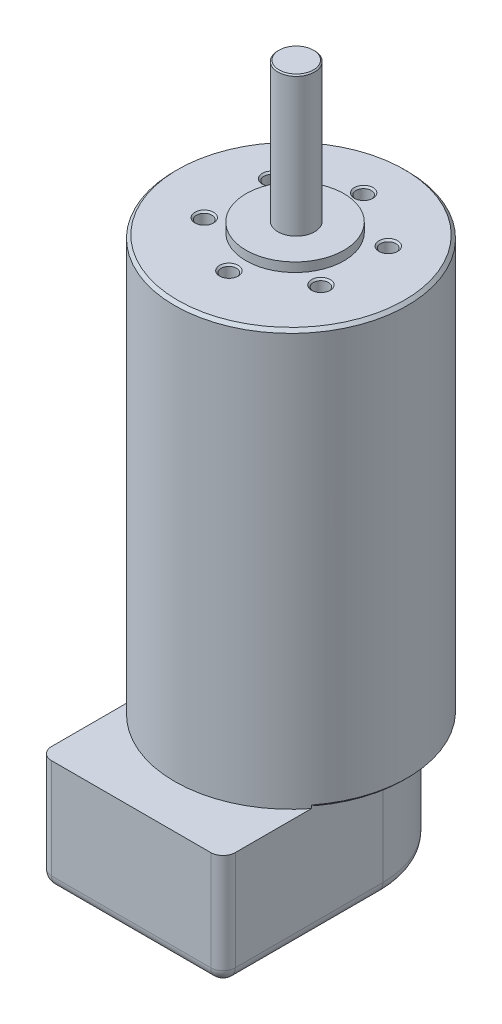
ISO-10303-21;
HEADER;
FILE_DESCRIPTION(('STEP AP214'),'2;1');
FILE_NAME('part.step','',(''),(''),'','','');
FILE_SCHEMA(('AUTOMOTIVE_DESIGN { 1 0 10303 214 1 1 1 1 }'));
ENDSEC;
DATA;
#1=APPLICATION_CONTEXT('core data for automotive mechanical design processes');
#2=APPLICATION_PROTOCOL_DEFINITION('international standard','automotive_design',2000,#1);
#3=PRODUCT_CONTEXT('',#1,'mechanical');
#4=PRODUCT('Part','Part','',(#3));
#5=PRODUCT_RELATED_PRODUCT_CATEGORY('part','',(#4));
#6=PRODUCT_DEFINITION_FORMATION('','',#4);
#7=PRODUCT_DEFINITION_CONTEXT('part definition',#1,'design');
#8=PRODUCT_DEFINITION('design','',#6,#7);
#9=PRODUCT_DEFINITION_SHAPE('','',#8);
#10=(LENGTH_UNIT() NAMED_UNIT(*) SI_UNIT(.MILLI.,.METRE.));
#11=(NAMED_UNIT(*) PLANE_ANGLE_UNIT() SI_UNIT($,.RADIAN.));
#12=(NAMED_UNIT(*) SI_UNIT($,.STERADIAN.) SOLID_ANGLE_UNIT());
#13=UNCERTAINTY_MEASURE_WITH_UNIT(LENGTH_MEASURE(1.E-05),#10,'distance_accuracy_value','');
#14=(GEOMETRIC_REPRESENTATION_CONTEXT(3) GLOBAL_UNCERTAINTY_ASSIGNED_CONTEXT((#13)) GLOBAL_UNIT_ASSIGNED_CONTEXT((#10,
#11,#12)) REPRESENTATION_CONTEXT('',''));
#15=CARTESIAN_POINT('',(0.,0.,0.));
#16=DIRECTION('',(0.,0.,1.));
#17=DIRECTION('',(1.,0.,0.));
#18=AXIS2_PLACEMENT_3D('',#15,#16,#17);
#19=CARTESIAN_POINT('',(13.,18.3,12.05));
#20=DIRECTION('',(0.,-1.,0.));
#21=DIRECTION('',(0.,0.,-1.));
#22=AXIS2_PLACEMENT_3D('',#19,#20,#21);
#23=CYLINDRICAL_SURFACE('',#22,2.);
#24=DIRECTION('',(0.,-1.,0.));
#25=VECTOR('',#24,1.);
#26=CARTESIAN_POINT('',(13.,18.3,14.05));
#27=LINE('',#26,#25);
#28=CARTESIAN_POINT('',(13.,18.3,14.05));
#29=VERTEX_POINT('',#28);
#30=CARTESIAN_POINT('',(13.,2.,14.05));
#31=VERTEX_POINT('',#30);
#32=EDGE_CURVE('E233',#29,#31,#27,.T.);
#33=ORIENTED_EDGE('',*,*,#32,.T.);
#34=CARTESIAN_POINT('',(13.,2.,12.05));
#35=DIRECTION('',(0.,-1.,0.));
#36=DIRECTION('',(0.,0.,-1.));
#37=AXIS2_PLACEMENT_3D('',#34,#35,#36);
#38=CIRCLE('',#37,2.);
#39=CARTESIAN_POINT('',(15.,2.,12.05));
#40=VERTEX_POINT('',#39);
#41=EDGE_CURVE('E269',#31,#40,#38,.F.);
#42=ORIENTED_EDGE('',*,*,#41,.T.);
#43=DIRECTION('',(0.,-1.,0.));
#44=VECTOR('',#43,1.);
#45=CARTESIAN_POINT('',(15.,18.3,12.05));
#46=LINE('',#45,#44);
#47=CARTESIAN_POINT('',(15.,18.3,12.05));
#48=VERTEX_POINT('',#47);
#49=EDGE_CURVE('E248',#48,#40,#46,.T.);
#50=ORIENTED_EDGE('',*,*,#49,.F.);
#51=CARTESIAN_POINT('',(13.,18.3,12.05));
#52=DIRECTION('',(0.,1.,0.));
#53=DIRECTION('',(0.,0.,1.));
#54=AXIS2_PLACEMENT_3D('',#51,#52,#53);
#55=CIRCLE('',#54,2.);
#56=EDGE_CURVE('E215',#29,#48,#55,.T.);
#57=ORIENTED_EDGE('',*,*,#56,.F.);
#58=EDGE_LOOP('',(#33,#42,#50,#57));
#59=FACE_BOUND('',#58,.T.);
#60=ADVANCED_FACE('F34',(#59),#23,.T.);
#61=CARTESIAN_POINT('',(15.,18.3,-12.05));
#62=DIRECTION('',(-1.,0.,0.));
#63=DIRECTION('',(0.,0.,1.));
#64=AXIS2_PLACEMENT_3D('',#61,#62,#63);
#65=PLANE('',#64);
#66=ORIENTED_EDGE('',*,*,#49,.T.);
#67=DIRECTION('',(0.,0.,-1.));
#68=VECTOR('',#67,1.);
#69=CARTESIAN_POINT('',(15.,2.,-12.05));
#70=LINE('',#69,#68);
#71=CARTESIAN_POINT('',(15.,2.,-12.05));
#72=VERTEX_POINT('',#71);
#73=EDGE_CURVE('E267',#40,#72,#70,.T.);
#74=ORIENTED_EDGE('',*,*,#73,.T.);
#75=DIRECTION('',(0.,-1.,0.));
#76=VECTOR('',#75,1.);
#77=CARTESIAN_POINT('',(15.,18.3,-12.05));
#78=LINE('',#77,#76);
#79=CARTESIAN_POINT('',(15.,18.3,-12.05));
#80=VERTEX_POINT('',#79);
#81=EDGE_CURVE('E245',#80,#72,#78,.T.);
#82=ORIENTED_EDGE('',*,*,#81,.F.);
#83=DIRECTION('',(0.,0.,-1.));
#84=VECTOR('',#83,1.);
#85=CARTESIAN_POINT('',(15.,18.3,-12.05));
#86=LINE('',#85,#84);
#87=CARTESIAN_POINT('',(15.,18.3,-1.22179608614613));
#88=VERTEX_POINT('',#87);
#89=EDGE_CURVE('E218',#88,#80,#86,.T.);
#90=ORIENTED_EDGE('',*,*,#89,.F.);
#91=CARTESIAN_POINT('',(15.,18.3,-1.22179608614613));
#92=CARTESIAN_POINT('',(15.,18.3818785551797,-1.08197355466219));
#93=CARTESIAN_POINT('',(15.,18.4644845149293,-0.942587274036707));
#94=CARTESIAN_POINT('',(15.,18.6311511826593,-0.66468731606218));
#95=CARTESIAN_POINT('',(15.,18.7152118895763,-0.526173638075423));
#96=CARTESIAN_POINT('',(15.,18.8,-0.3880962103094));
#97=B_SPLINE_CURVE_WITH_KNOTS('',3,(#91,#92,#93,#94,#95,#96),.UNSPECIFIED.,.F.,.F.,(4,2,4),(0.,
0.486076658887052,0.972152962497277),.UNSPECIFIED.);
#98=CARTESIAN_POINT('',(15.,18.8,-0.388096210309399));
#99=VERTEX_POINT('',#98);
#100=EDGE_CURVE('E11',#88,#99,#97,.T.);
#101=ORIENTED_EDGE('',*,*,#100,.T.);
#102=DIRECTION('',(0.,-1.,0.));
#103=VECTOR('',#102,1.);
#104=CARTESIAN_POINT('',(15.,18.3,-0.388096210309399));
#105=LINE('',#104,#103);
#106=CARTESIAN_POINT('',(15.,18.3,-0.388096210309399));
#107=VERTEX_POINT('',#106);
#108=EDGE_CURVE('E53',#107,#99,#105,.F.);
#109=ORIENTED_EDGE('',*,*,#108,.F.);
#110=EDGE_CURVE('E220',#48,#107,#86,.T.);
#111=ORIENTED_EDGE('',*,*,#110,.F.);
#112=EDGE_LOOP('',(#66,#74,#82,#90,#101,#109,#111));
#113=FACE_BOUND('',#112,.T.);
#114=ADVANCED_FACE('F315',(#113),#65,.F.);
#115=CARTESIAN_POINT('',(0.,18.3,-12.05));
#116=DIRECTION('',(0.,-1.,0.));
#117=DIRECTION('',(0.,0.,-1.));
#118=AXIS2_PLACEMENT_3D('',#115,#116,#117);
#119=CYLINDRICAL_SURFACE('',#118,15.);
#120=ORIENTED_EDGE('',*,*,#81,.T.);
#121=CARTESIAN_POINT('',(0.,2.,-12.05));
#122=DIRECTION('',(0.,1.,0.));
#123=DIRECTION('',(0.,0.,1.));
#124=AXIS2_PLACEMENT_3D('',#121,#122,#123);
#125=CIRCLE('',#124,15.);
#126=CARTESIAN_POINT('',(-15.,2.,-12.05));
#127=VERTEX_POINT('',#126);
#128=EDGE_CURVE('E265',#72,#127,#125,.T.);
#129=ORIENTED_EDGE('',*,*,#128,.T.);
#130=DIRECTION('',(0.,-1.,0.));
#131=VECTOR('',#130,1.);
#132=CARTESIAN_POINT('',(-15.,18.3,-12.05));
#133=LINE('',#132,#131);
#134=CARTESIAN_POINT('',(-15.,18.3,-12.05));
#135=VERTEX_POINT('',#134);
#136=EDGE_CURVE('E242',#135,#127,#133,.T.);
#137=ORIENTED_EDGE('',*,*,#136,.F.);
#138=CARTESIAN_POINT('',(0.,18.3,-12.05));
#139=DIRECTION('',(0.,1.,0.));
#140=DIRECTION('',(0.,0.,-1.));
#141=AXIS2_PLACEMENT_3D('',#138,#139,#140);
#142=CIRCLE('',#141,15.);
#143=EDGE_CURVE('E223',#80,#135,#142,.T.);
#144=ORIENTED_EDGE('',*,*,#143,.F.);
#145=EDGE_LOOP('',(#120,#129,#137,#144));
#146=FACE_BOUND('',#145,.T.);
#147=ADVANCED_FACE('F312',(#146),#119,.T.);
#148=CARTESIAN_POINT('',(-15.,18.3,-12.05));
#149=DIRECTION('',(1.,0.,0.));
#150=DIRECTION('',(0.,0.,-1.));
#151=AXIS2_PLACEMENT_3D('',#148,#149,#150);
#152=PLANE('',#151);
#153=ORIENTED_EDGE('',*,*,#136,.T.);
#154=DIRECTION('',(0.,0.,1.));
#155=VECTOR('',#154,1.);
#156=CARTESIAN_POINT('',(-15.,2.,-12.05));
#157=LINE('',#156,#155);
#158=CARTESIAN_POINT('',(-15.,2.,12.05));
#159=VERTEX_POINT('',#158);
#160=EDGE_CURVE('E254',#127,#159,#157,.T.);
#161=ORIENTED_EDGE('',*,*,#160,.T.);
#162=DIRECTION('',(0.,-1.,0.));
#163=VECTOR('',#162,1.);
#164=CARTESIAN_POINT('',(-15.,18.3,12.05));
#165=LINE('',#164,#163);
#166=CARTESIAN_POINT('',(-15.,18.3,12.05));
#167=VERTEX_POINT('',#166);
#168=EDGE_CURVE('E239',#167,#159,#165,.T.);
#169=ORIENTED_EDGE('',*,*,#168,.F.);
#170=DIRECTION('',(0.,0.,1.));
#171=VECTOR('',#170,1.);
#172=CARTESIAN_POINT('',(-15.,18.3,-12.05));
#173=LINE('',#172,#171);
#174=CARTESIAN_POINT('',(-15.,18.3,-0.388096210309399));
#175=VERTEX_POINT('',#174);
#176=EDGE_CURVE('E226',#175,#167,#173,.T.);
#177=ORIENTED_EDGE('',*,*,#176,.F.);
#178=DIRECTION('',(0.,-1.,0.));
#179=VECTOR('',#178,1.);
#180=CARTESIAN_POINT('',(-15.,18.8,-0.388096210309399));
#181=LINE('',#180,#179);
#182=CARTESIAN_POINT('',(-15.,18.8,-0.388096210309399));
#183=VERTEX_POINT('',#182);
#184=EDGE_CURVE('E299',#183,#175,#181,.T.);
#185=ORIENTED_EDGE('',*,*,#184,.F.);
#186=CARTESIAN_POINT('',(-15.,18.8,-0.388096210309399));
#187=CARTESIAN_POINT('',(-15.,18.7152118895763,-0.526173638075423));
#188=CARTESIAN_POINT('',(-15.,18.6311511826593,-0.664687316062179));
#189=CARTESIAN_POINT('',(-15.,18.4644845149293,-0.942587274036707));
#190=CARTESIAN_POINT('',(-15.,18.3818785551797,-1.08197355466219));
#191=CARTESIAN_POINT('',(-15.,18.3,-1.22179608614613));
#192=B_SPLINE_CURVE_WITH_KNOTS('',3,(#186,#187,#188,#189,#190,#191),.UNSPECIFIED.,.F.,.F.,(4,2,
4),(0.,0.486076303610225,0.972152962497278),.UNSPECIFIED.);
#193=CARTESIAN_POINT('',(-15.,18.3,-1.22179608614613));
#194=VERTEX_POINT('',#193);
#195=EDGE_CURVE('E47',#183,#194,#192,.T.);
#196=ORIENTED_EDGE('',*,*,#195,.T.);
#197=EDGE_CURVE('E227',#135,#194,#173,.T.);
#198=ORIENTED_EDGE('',*,*,#197,.F.);
#199=EDGE_LOOP('',(#153,#161,#169,#177,#185,#196,#198));
#200=FACE_BOUND('',#199,.T.);
#201=ADVANCED_FACE('F306',(#200),#152,.F.);
#202=CARTESIAN_POINT('',(-13.,18.3,12.05));
#203=DIRECTION('',(0.,-1.,0.));
#204=DIRECTION('',(0.,0.,-1.));
#205=AXIS2_PLACEMENT_3D('',#202,#203,#204);
#206=CYLINDRICAL_SURFACE('',#205,2.);
#207=ORIENTED_EDGE('',*,*,#168,.T.);
#208=CARTESIAN_POINT('',(-13.,2.,12.05));
#209=DIRECTION('',(0.,-1.,0.));
#210=DIRECTION('',(0.,0.,-1.));
#211=AXIS2_PLACEMENT_3D('',#208,#209,#210);
#212=CIRCLE('',#211,2.);
#213=CARTESIAN_POINT('',(-13.,2.,14.05));
#214=VERTEX_POINT('',#213);
#215=EDGE_CURVE('E251',#159,#214,#212,.F.);
#216=ORIENTED_EDGE('',*,*,#215,.T.);
#217=DIRECTION('',(0.,-1.,0.));
#218=VECTOR('',#217,1.);
#219=CARTESIAN_POINT('',(-13.,18.3,14.05));
#220=LINE('',#219,#218);
#221=CARTESIAN_POINT('',(-13.,18.3,14.05));
#222=VERTEX_POINT('',#221);
#223=EDGE_CURVE('E236',#222,#214,#220,.T.);
#224=ORIENTED_EDGE('',*,*,#223,.F.);
#225=CARTESIAN_POINT('',(-13.,18.3,12.05));
#226=DIRECTION('',(0.,1.,0.));
#227=DIRECTION('',(0.,0.,1.));
#228=AXIS2_PLACEMENT_3D('',#225,#226,#227);
#229=CIRCLE('',#228,2.);
#230=EDGE_CURVE('E229',#167,#222,#229,.T.);
#231=ORIENTED_EDGE('',*,*,#230,.F.);
#232=EDGE_LOOP('',(#207,#216,#224,#231));
#233=FACE_BOUND('',#232,.T.);
#234=ADVANCED_FACE('F311',(#233),#206,.T.);
#235=CARTESIAN_POINT('',(-13.,18.3,14.05));
#236=DIRECTION('',(0.,0.,-1.));
#237=DIRECTION('',(-1.,0.,0.));
#238=AXIS2_PLACEMENT_3D('',#235,#236,#237);
#239=PLANE('',#238);
#240=ORIENTED_EDGE('',*,*,#223,.T.);
#241=DIRECTION('',(1.,0.,0.));
#242=VECTOR('',#241,1.);
#243=CARTESIAN_POINT('',(-13.,2.,14.05));
#244=LINE('',#243,#242);
#245=EDGE_CURVE('E214',#214,#31,#244,.T.);
#246=ORIENTED_EDGE('',*,*,#245,.T.);
#247=ORIENTED_EDGE('',*,*,#32,.F.);
#248=DIRECTION('',(1.,0.,0.));
#249=VECTOR('',#248,1.);
#250=CARTESIAN_POINT('',(-13.,18.3,14.05));
#251=LINE('',#250,#249);
#252=EDGE_CURVE('E231',#222,#29,#251,.T.);
#253=ORIENTED_EDGE('',*,*,#252,.F.);
#254=EDGE_LOOP('',(#240,#246,#247,#253));
#255=FACE_BOUND('',#254,.T.);
#256=ADVANCED_FACE('F410',(#255),#239,.F.);
#257=CARTESIAN_POINT('',(13.,18.3,12.05));
#258=DIRECTION('',(0.,1.,0.));
#259=DIRECTION('',(0.,0.,1.));
#260=AXIS2_PLACEMENT_3D('',#257,#258,#259);
#261=PLANE('',#260);
#262=CARTESIAN_POINT('',(0.,18.3,-12.05));
#263=DIRECTION('',(0.,1.,0.));
#264=DIRECTION('',(0.,0.,1.));
#265=AXIS2_PLACEMENT_3D('',#262,#263,#264);
#266=CIRCLE('',#265,19.);
#267=EDGE_CURVE('E211',#175,#107,#266,.T.);
#268=ORIENTED_EDGE('',*,*,#267,.F.);
#269=ORIENTED_EDGE('',*,*,#176,.T.);
#270=ORIENTED_EDGE('',*,*,#230,.T.);
#271=ORIENTED_EDGE('',*,*,#252,.T.);
#272=ORIENTED_EDGE('',*,*,#56,.T.);
#273=ORIENTED_EDGE('',*,*,#110,.T.);
#274=EDGE_LOOP('',(#268,#269,#270,#271,#272,#273));
#275=FACE_BOUND('',#274,.T.);
#276=ADVANCED_FACE('F407',(#275),#261,.T.);
#277=CARTESIAN_POINT('',(13.,0.,12.05));
#278=DIRECTION('',(0.,1.,0.));
#279=DIRECTION('',(0.,0.,1.));
#280=AXIS2_PLACEMENT_3D('',#277,#278,#279);
#281=PLANE('',#280);
#282=DIRECTION('',(1.,0.,0.));
#283=VECTOR('',#282,1.);
#284=CARTESIAN_POINT('',(13.,0.,12.05));
#285=LINE('',#284,#283);
#286=CARTESIAN_POINT('',(13.,0.,12.05));
#287=VERTEX_POINT('',#286);
#288=CARTESIAN_POINT('',(-13.,0.,12.05));
#289=VERTEX_POINT('',#288);
#290=EDGE_CURVE('E256',#287,#289,#285,.F.);
#291=ORIENTED_EDGE('',*,*,#290,.T.);
#292=DIRECTION('',(0.,0.,1.));
#293=VECTOR('',#292,1.);
#294=CARTESIAN_POINT('',(-13.,0.,12.05));
#295=LINE('',#294,#293);
#296=CARTESIAN_POINT('',(-13.,0.,-12.05));
#297=VERTEX_POINT('',#296);
#298=EDGE_CURVE('E262',#289,#297,#295,.F.);
#299=ORIENTED_EDGE('',*,*,#298,.T.);
#300=CARTESIAN_POINT('',(0.,0.,-12.05));
#301=DIRECTION('',(0.,1.,0.));
#302=DIRECTION('',(0.,0.,1.));
#303=AXIS2_PLACEMENT_3D('',#300,#301,#302);
#304=CIRCLE('',#303,13.);
#305=CARTESIAN_POINT('',(13.,0.,-12.05));
#306=VERTEX_POINT('',#305);
#307=EDGE_CURVE('E260',#297,#306,#304,.F.);
#308=ORIENTED_EDGE('',*,*,#307,.T.);
#309=DIRECTION('',(0.,0.,-1.));
#310=VECTOR('',#309,1.);
#311=CARTESIAN_POINT('',(13.,0.,12.05));
#312=LINE('',#311,#310);
#313=EDGE_CURVE('E258',#306,#287,#312,.F.);
#314=ORIENTED_EDGE('',*,*,#313,.T.);
#315=EDGE_LOOP('',(#291,#299,#308,#314));
#316=FACE_BOUND('',#315,.T.);
#317=ADVANCED_FACE('F347',(#316),#281,.F.);
#318=CARTESIAN_POINT('',(13.,2.,-12.05));
#319=DIRECTION('',(0.,0.,-1.));
#320=DIRECTION('',(-1.,0.,0.));
#321=AXIS2_PLACEMENT_3D('',#318,#319,#320);
#322=CYLINDRICAL_SURFACE('',#321,2.);
#323=CARTESIAN_POINT('',(13.,2.,12.05));
#324=DIRECTION('',(0.,0.,1.));
#325=DIRECTION('',(1.,0.,0.));
#326=AXIS2_PLACEMENT_3D('',#323,#324,#325);
#327=CIRCLE('',#326,2.);
#328=EDGE_CURVE('E281',#287,#40,#327,.T.);
#329=ORIENTED_EDGE('',*,*,#328,.F.);
#330=ORIENTED_EDGE('',*,*,#313,.F.);
#331=CARTESIAN_POINT('',(13.,2.,-12.05));
#332=DIRECTION('',(0.,0.,-1.));
#333=DIRECTION('',(-1.,0.,0.));
#334=AXIS2_PLACEMENT_3D('',#331,#332,#333);
#335=CIRCLE('',#334,2.);
#336=EDGE_CURVE('E219',#72,#306,#335,.T.);
#337=ORIENTED_EDGE('',*,*,#336,.F.);
#338=ORIENTED_EDGE('',*,*,#73,.F.);
#339=EDGE_LOOP('',(#329,#330,#337,#338));
#340=FACE_BOUND('',#339,.T.);
#341=ADVANCED_FACE('F343',(#340),#322,.T.);
#342=CARTESIAN_POINT('',(0.,2.,-12.05));
#343=DIRECTION('',(0.,1.,0.));
#344=DIRECTION('',(0.,0.,1.));
#345=AXIS2_PLACEMENT_3D('',#342,#343,#344);
#346=TOROIDAL_SURFACE('',#345,13.,2.);
#347=ORIENTED_EDGE('',*,*,#336,.T.);
#348=ORIENTED_EDGE('',*,*,#307,.F.);
#349=CARTESIAN_POINT('',(-13.,2.,-12.05));
#350=DIRECTION('',(0.,0.,1.));
#351=DIRECTION('',(1.,0.,0.));
#352=AXIS2_PLACEMENT_3D('',#349,#350,#351);
#353=CIRCLE('',#352,2.);
#354=EDGE_CURVE('E279',#127,#297,#353,.T.);
#355=ORIENTED_EDGE('',*,*,#354,.F.);
#356=ORIENTED_EDGE('',*,*,#128,.F.);
#357=EDGE_LOOP('',(#347,#348,#355,#356));
#358=FACE_BOUND('',#357,.T.);
#359=ADVANCED_FACE('F339',(#358),#346,.T.);
#360=CARTESIAN_POINT('',(13.,2.,12.05));
#361=DIRECTION('',(0.,1.,0.));
#362=DIRECTION('',(0.,0.,1.));
#363=AXIS2_PLACEMENT_3D('',#360,#361,#362);
#364=SPHERICAL_SURFACE('',#363,2.);
#365=ORIENTED_EDGE('',*,*,#328,.T.);
#366=ORIENTED_EDGE('',*,*,#41,.F.);
#367=CARTESIAN_POINT('',(13.,2.,12.05));
#368=DIRECTION('',(-1.,0.,0.));
#369=DIRECTION('',(0.,0.,1.));
#370=AXIS2_PLACEMENT_3D('',#367,#368,#369);
#371=CIRCLE('',#370,2.);
#372=EDGE_CURVE('E276',#287,#31,#371,.T.);
#373=ORIENTED_EDGE('',*,*,#372,.F.);
#374=EDGE_LOOP('',(#365,#366,#373));
#375=FACE_BOUND('',#374,.T.);
#376=ADVANCED_FACE('F335',(#375),#364,.T.);
#377=CARTESIAN_POINT('',(-13.,2.,-12.05));
#378=DIRECTION('',(0.,0.,1.));
#379=DIRECTION('',(1.,0.,0.));
#380=AXIS2_PLACEMENT_3D('',#377,#378,#379);
#381=CYLINDRICAL_SURFACE('',#380,2.);
#382=ORIENTED_EDGE('',*,*,#354,.T.);
#383=ORIENTED_EDGE('',*,*,#298,.F.);
#384=CARTESIAN_POINT('',(-13.,2.,12.05));
#385=DIRECTION('',(0.,0.,1.));
#386=DIRECTION('',(1.,0.,0.));
#387=AXIS2_PLACEMENT_3D('',#384,#385,#386);
#388=CIRCLE('',#387,2.);
#389=EDGE_CURVE('E273',#159,#289,#388,.T.);
#390=ORIENTED_EDGE('',*,*,#389,.F.);
#391=ORIENTED_EDGE('',*,*,#160,.F.);
#392=EDGE_LOOP('',(#382,#383,#390,#391));
#393=FACE_BOUND('',#392,.T.);
#394=ADVANCED_FACE('F331',(#393),#381,.T.);
#395=CARTESIAN_POINT('',(-13.,2.,12.05));
#396=DIRECTION('',(1.,0.,0.));
#397=DIRECTION('',(0.,0.,-1.));
#398=AXIS2_PLACEMENT_3D('',#395,#396,#397);
#399=CYLINDRICAL_SURFACE('',#398,2.);
#400=ORIENTED_EDGE('',*,*,#372,.T.);
#401=ORIENTED_EDGE('',*,*,#245,.F.);
#402=CARTESIAN_POINT('',(-13.,2.,12.05));
#403=DIRECTION('',(-1.,0.,0.));
#404=DIRECTION('',(0.,0.,1.));
#405=AXIS2_PLACEMENT_3D('',#402,#403,#404);
#406=CIRCLE('',#405,2.);
#407=EDGE_CURVE('E207',#289,#214,#406,.T.);
#408=ORIENTED_EDGE('',*,*,#407,.F.);
#409=ORIENTED_EDGE('',*,*,#290,.F.);
#410=EDGE_LOOP('',(#400,#401,#408,#409));
#411=FACE_BOUND('',#410,.T.);
#412=ADVANCED_FACE('F327',(#411),#399,.T.);
#413=CARTESIAN_POINT('',(-13.,2.,12.05));
#414=DIRECTION('',(0.,1.,0.));
#415=DIRECTION('',(0.,0.,1.));
#416=AXIS2_PLACEMENT_3D('',#413,#414,#415);
#417=SPHERICAL_SURFACE('',#416,2.);
#418=ORIENTED_EDGE('',*,*,#215,.F.);
#419=ORIENTED_EDGE('',*,*,#389,.T.);
#420=ORIENTED_EDGE('',*,*,#407,.T.);
#421=EDGE_LOOP('',(#418,#419,#420));
#422=FACE_BOUND('',#421,.T.);
#423=ADVANCED_FACE('F323',(#422),#417,.T.);
#424=CARTESIAN_POINT('',(0.,18.3,-12.05));
#425=DIRECTION('',(0.,1.,0.));
#426=DIRECTION('',(0.,0.,1.));
#427=AXIS2_PLACEMENT_3D('',#424,#425,#426);
#428=PLANE('',#427);
#429=ORIENTED_EDGE('',*,*,#197,.T.);
#430=CARTESIAN_POINT('',(0.,18.3,-12.05));
#431=DIRECTION('',(0.,1.,0.));
#432=DIRECTION('',(0.,0.,1.));
#433=AXIS2_PLACEMENT_3D('',#430,#431,#432);
#434=CIRCLE('',#433,18.5);
#435=EDGE_CURVE('E301',#194,#88,#434,.F.);
#436=ORIENTED_EDGE('',*,*,#435,.T.);
#437=ORIENTED_EDGE('',*,*,#89,.T.);
#438=ORIENTED_EDGE('',*,*,#143,.T.);
#439=EDGE_LOOP('',(#429,#436,#437,#438));
#440=FACE_BOUND('',#439,.T.);
#441=ADVANCED_FACE('F326',(#440),#428,.F.);
#442=CARTESIAN_POINT('',(0.,86.1,-12.05));
#443=DIRECTION('',(0.,-1.,0.));
#444=DIRECTION('',(0.,0.,-1.));
#445=AXIS2_PLACEMENT_3D('',#442,#443,#444);
#446=CYLINDRICAL_SURFACE('',#445,19.);
#447=CARTESIAN_POINT('',(0.,85.6,-12.05));
#448=DIRECTION('',(0.,1.,0.));
#449=DIRECTION('',(0.,0.,1.));
#450=AXIS2_PLACEMENT_3D('',#447,#448,#449);
#451=CIRCLE('',#450,19.);
#452=CARTESIAN_POINT('',(0.,85.6,6.95));
#453=VERTEX_POINT('',#452);
#454=EDGE_CURVE('E210',#453,#453,#451,.F.);
#455=ORIENTED_EDGE('',*,*,#454,.T.);
#456=EDGE_LOOP('',(#455));
#457=FACE_BOUND('',#456,.T.);
#458=CARTESIAN_POINT('',(0.,18.8,-12.05));
#459=DIRECTION('',(0.,1.,0.));
#460=DIRECTION('',(0.,0.,1.));
#461=AXIS2_PLACEMENT_3D('',#458,#459,#460);
#462=CIRCLE('',#461,19.);
#463=EDGE_CURVE('E296',#99,#183,#462,.T.);
#464=ORIENTED_EDGE('',*,*,#463,.T.);
#465=ORIENTED_EDGE('',*,*,#184,.T.);
#466=ORIENTED_EDGE('',*,*,#267,.T.);
#467=ORIENTED_EDGE('',*,*,#108,.T.);
#468=EDGE_LOOP('',(#464,#465,#466,#467));
#469=FACE_BOUND('',#468,.T.);
#470=ADVANCED_FACE('F391',(#457,#469),#446,.T.);
#471=CARTESIAN_POINT('',(0.,86.1,-12.05));
#472=DIRECTION('',(0.,1.,0.));
#473=DIRECTION('',(0.,0.,1.));
#474=AXIS2_PLACEMENT_3D('',#471,#472,#473);
#475=PLANE('',#474);
#476=CARTESIAN_POINT('',(-9.52627944162876,86.1,-18.4106432374949));
#477=DIRECTION('',(0.,1.,0.));
#478=DIRECTION('',(0.,0.,1.));
#479=AXIS2_PLACEMENT_3D('',#476,#477,#478);
#480=CIRCLE('',#479,1.525);
#481=CARTESIAN_POINT('',(-9.52627944162876,86.1,-16.8856432374949));
#482=VERTEX_POINT('',#481);
#483=EDGE_CURVE('E154',#482,#482,#480,.T.);
#484=ORIENTED_EDGE('',*,*,#483,.F.);
#485=EDGE_LOOP('',(#484));
#486=FACE_BOUND('',#485,.T.);
#487=CARTESIAN_POINT('',(-9.52627944162887,86.1,-7.41064323749491));
#488=DIRECTION('',(0.,1.,0.));
#489=DIRECTION('',(0.,0.,1.));
#490=AXIS2_PLACEMENT_3D('',#487,#488,#489);
#491=CIRCLE('',#490,1.525);
#492=CARTESIAN_POINT('',(-9.52627944162887,86.1,-5.88564323749491));
#493=VERTEX_POINT('',#492);
#494=EDGE_CURVE('E147',#493,#493,#491,.T.);
#495=ORIENTED_EDGE('',*,*,#494,.F.);
#496=EDGE_LOOP('',(#495));
#497=FACE_BOUND('',#496,.T.);
#498=CARTESIAN_POINT('',(0.,86.1,-1.91064323749482));
#499=DIRECTION('',(0.,1.,0.));
#500=DIRECTION('',(0.,0.,1.));
#501=AXIS2_PLACEMENT_3D('',#498,#499,#500);
#502=CIRCLE('',#501,1.525);
#503=CARTESIAN_POINT('',(0.,86.1,-0.385643237494823));
#504=VERTEX_POINT('',#503);
#505=EDGE_CURVE('E163',#504,#504,#502,.T.);
#506=ORIENTED_EDGE('',*,*,#505,.F.);
#507=EDGE_LOOP('',(#506));
#508=FACE_BOUND('',#507,.T.);
#509=CARTESIAN_POINT('',(9.5262794416288,86.1,-7.41064323749478));
#510=DIRECTION('',(0.,1.,0.));
#511=DIRECTION('',(0.,0.,1.));
#512=AXIS2_PLACEMENT_3D('',#509,#510,#511);
#513=CIRCLE('',#512,1.525);
#514=CARTESIAN_POINT('',(9.5262794416288,86.1,-5.88564323749478));
#515=VERTEX_POINT('',#514);
#516=EDGE_CURVE('E172',#515,#515,#513,.T.);
#517=ORIENTED_EDGE('',*,*,#516,.F.);
#518=EDGE_LOOP('',(#517));
#519=FACE_BOUND('',#518,.T.);
#520=CARTESIAN_POINT('',(9.52627944162884,86.1,-18.4106432374948));
#521=DIRECTION('',(0.,1.,0.));
#522=DIRECTION('',(0.,0.,1.));
#523=AXIS2_PLACEMENT_3D('',#520,#521,#522);
#524=CIRCLE('',#523,1.525);
#525=CARTESIAN_POINT('',(9.52627944162884,86.1,-16.8856432374948));
#526=VERTEX_POINT('',#525);
#527=EDGE_CURVE('E181',#526,#526,#524,.T.);
#528=ORIENTED_EDGE('',*,*,#527,.F.);
#529=EDGE_LOOP('',(#528));
#530=FACE_BOUND('',#529,.T.);
#531=CARTESIAN_POINT('',(0.,86.1,-23.9106432374948));
#532=DIRECTION('',(0.,1.,0.));
#533=DIRECTION('',(0.,0.,1.));
#534=AXIS2_PLACEMENT_3D('',#531,#532,#533);
#535=CIRCLE('',#534,1.525);
#536=CARTESIAN_POINT('',(0.,86.1,-22.3856432374948));
#537=VERTEX_POINT('',#536);
#538=EDGE_CURVE('E190',#537,#537,#535,.T.);
#539=ORIENTED_EDGE('',*,*,#538,.F.);
#540=EDGE_LOOP('',(#539));
#541=FACE_BOUND('',#540,.T.);
#542=CARTESIAN_POINT('',(0.,86.1,-12.7086290434111));
#543=DIRECTION('',(0.,1.,0.));
#544=DIRECTION('',(0.,0.,1.));
#545=AXIS2_PLACEMENT_3D('',#542,#543,#544);
#546=CIRCLE('',#545,8.);
#547=CARTESIAN_POINT('',(0.,86.1,-4.70862904341109));
#548=VERTEX_POINT('',#547);
#549=EDGE_CURVE('E204',#548,#548,#546,.T.);
#550=ORIENTED_EDGE('',*,*,#549,.F.);
#551=EDGE_LOOP('',(#550));
#552=FACE_BOUND('',#551,.T.);
#553=CARTESIAN_POINT('',(0.,86.1,-12.05));
#554=DIRECTION('',(0.,1.,0.));
#555=DIRECTION('',(0.,0.,1.));
#556=AXIS2_PLACEMENT_3D('',#553,#554,#555);
#557=CIRCLE('',#556,18.5);
#558=CARTESIAN_POINT('',(0.,86.1,6.45));
#559=VERTEX_POINT('',#558);
#560=EDGE_CURVE('E213',#559,#559,#557,.T.);
#561=ORIENTED_EDGE('',*,*,#560,.T.);
#562=EDGE_LOOP('',(#561));
#563=FACE_BOUND('',#562,.T.);
#564=ADVANCED_FACE('F352',(#486,#497,#508,#519,#530,#541,#552,#563),#475,.T.);
#565=CARTESIAN_POINT('',(0.,86.1,-12.05));
#566=DIRECTION('',(0.,-1.,0.));
#567=DIRECTION('',(0.,0.,-1.));
#568=AXIS2_PLACEMENT_3D('',#565,#566,#567);
#569=CONICAL_SURFACE('',#568,18.5,0.785398163397445);
#570=ORIENTED_EDGE('',*,*,#454,.F.);
#571=EDGE_LOOP('',(#570));
#572=FACE_BOUND('',#571,.T.);
#573=ORIENTED_EDGE('',*,*,#560,.F.);
#574=EDGE_LOOP('',(#573));
#575=FACE_BOUND('',#574,.T.);
#576=ADVANCED_FACE('F349',(#572,#575),#569,.T.);
#577=CARTESIAN_POINT('',(0.,87.6,-12.7086290434111));
#578=DIRECTION('',(0.,-1.,0.));
#579=DIRECTION('',(0.,0.,-1.));
#580=AXIS2_PLACEMENT_3D('',#577,#578,#579);
#581=CYLINDRICAL_SURFACE('',#580,8.);
#582=CARTESIAN_POINT('',(0.,87.6,-12.7086290434111));
#583=DIRECTION('',(0.,1.,0.));
#584=DIRECTION('',(0.,0.,1.));
#585=AXIS2_PLACEMENT_3D('',#582,#583,#584);
#586=CIRCLE('',#585,8.);
#587=CARTESIAN_POINT('',(0.,87.6,-4.70862904341109));
#588=VERTEX_POINT('',#587);
#589=EDGE_CURVE('E199',#588,#588,#586,.T.);
#590=ORIENTED_EDGE('',*,*,#589,.F.);
#591=EDGE_LOOP('',(#590));
#592=FACE_BOUND('',#591,.T.);
#593=ORIENTED_EDGE('',*,*,#549,.T.);
#594=EDGE_LOOP('',(#593));
#595=FACE_BOUND('',#594,.T.);
#596=ADVANCED_FACE('F351',(#592,#595),#581,.T.);
#597=CARTESIAN_POINT('',(0.,87.6,-12.7086290434111));
#598=DIRECTION('',(0.,1.,0.));
#599=DIRECTION('',(0.,0.,1.));
#600=AXIS2_PLACEMENT_3D('',#597,#598,#599);
#601=PLANE('',#600);
#602=CARTESIAN_POINT('',(0.,87.6,-12.9106432374948));
#603=DIRECTION('',(0.,1.,0.));
#604=DIRECTION('',(0.,0.,1.));
#605=AXIS2_PLACEMENT_3D('',#602,#603,#604);
#606=CIRCLE('',#605,3.);
#607=CARTESIAN_POINT('',(0.,87.6,-9.91064323749482));
#608=VERTEX_POINT('',#607);
#609=EDGE_CURVE('E200',#608,#608,#606,.T.);
#610=ORIENTED_EDGE('',*,*,#609,.F.);
#611=EDGE_LOOP('',(#610));
#612=FACE_BOUND('',#611,.T.);
#613=ORIENTED_EDGE('',*,*,#589,.T.);
#614=EDGE_LOOP('',(#613));
#615=FACE_BOUND('',#614,.T.);
#616=ADVANCED_FACE('F375',(#612,#615),#601,.T.);
#617=CARTESIAN_POINT('',(0.,110.4,-12.9106432374948));
#618=DIRECTION('',(0.,-1.,0.));
#619=DIRECTION('',(0.,0.,-1.));
#620=AXIS2_PLACEMENT_3D('',#617,#618,#619);
#621=CYLINDRICAL_SURFACE('',#620,3.);
#622=CARTESIAN_POINT('',(0.,110.2,-12.9106432374948));
#623=DIRECTION('',(0.,1.,0.));
#624=DIRECTION('',(0.,0.,1.));
#625=AXIS2_PLACEMENT_3D('',#622,#623,#624);
#626=CIRCLE('',#625,3.);
#627=CARTESIAN_POINT('',(0.,110.2,-9.91064323749482));
#628=VERTEX_POINT('',#627);
#629=EDGE_CURVE('E292',#628,#628,#626,.F.);
#630=ORIENTED_EDGE('',*,*,#629,.T.);
#631=EDGE_LOOP('',(#630));
#632=FACE_BOUND('',#631,.T.);
#633=ORIENTED_EDGE('',*,*,#609,.T.);
#634=EDGE_LOOP('',(#633));
#635=FACE_BOUND('',#634,.T.);
#636=ADVANCED_FACE('F366',(#632,#635),#621,.T.);
#637=CARTESIAN_POINT('',(0.,110.4,-12.9106432374948));
#638=DIRECTION('',(0.,1.,0.));
#639=DIRECTION('',(0.,0.,1.));
#640=AXIS2_PLACEMENT_3D('',#637,#638,#639);
#641=PLANE('',#640);
#642=CARTESIAN_POINT('',(0.,110.4,-12.9106432374948));
#643=DIRECTION('',(0.,1.,0.));
#644=DIRECTION('',(0.,0.,1.));
#645=AXIS2_PLACEMENT_3D('',#642,#643,#644);
#646=CIRCLE('',#645,2.79999999999997);
#647=CARTESIAN_POINT('',(0.,110.4,-10.1106432374949));
#648=VERTEX_POINT('',#647);
#649=EDGE_CURVE('E203',#648,#648,#646,.T.);
#650=ORIENTED_EDGE('',*,*,#649,.T.);
#651=EDGE_LOOP('',(#650));
#652=FACE_BOUND('',#651,.T.);
#653=ADVANCED_FACE('F357',(#652),#641,.T.);
#654=CARTESIAN_POINT('',(0.,110.4,-12.9106432374948));
#655=DIRECTION('',(0.,-1.,0.));
#656=DIRECTION('',(0.,0.,-1.));
#657=AXIS2_PLACEMENT_3D('',#654,#655,#656);
#658=CONICAL_SURFACE('',#657,2.79999999999997,0.785398163397439);
#659=ORIENTED_EDGE('',*,*,#629,.F.);
#660=EDGE_LOOP('',(#659));
#661=FACE_BOUND('',#660,.T.);
#662=ORIENTED_EDGE('',*,*,#649,.F.);
#663=EDGE_LOOP('',(#662));
#664=FACE_BOUND('',#663,.T.);
#665=ADVANCED_FACE('F354',(#661,#664),#658,.T.);
#666=CARTESIAN_POINT('',(0.,83.1,-23.9106432374948));
#667=DIRECTION('',(0.,1.,0.));
#668=DIRECTION('',(0.,0.,1.));
#669=AXIS2_PLACEMENT_3D('',#666,#667,#668);
#670=CONICAL_SURFACE('',#669,1.25,1.02974425867666);
#671=CARTESIAN_POINT('',(0.,82.3489242262155,-23.9106432374948));
#672=VERTEX_POINT('',#671);
#673=VERTEX_LOOP('',#672);
#674=FACE_BOUND('',#673,.T.);
#675=CARTESIAN_POINT('',(0.,83.1,-23.9106432374948));
#676=DIRECTION('',(0.,1.,0.));
#677=DIRECTION('',(0.,0.,1.));
#678=AXIS2_PLACEMENT_3D('',#675,#676,#677);
#679=CIRCLE('',#678,1.25);
#680=CARTESIAN_POINT('',(0.,83.1,-22.6606432374948));
#681=VERTEX_POINT('',#680);
#682=EDGE_CURVE('E196',#681,#681,#679,.T.);
#683=ORIENTED_EDGE('',*,*,#682,.T.);
#684=EDGE_LOOP('',(#683));
#685=FACE_BOUND('',#684,.T.);
#686=ADVANCED_FACE('F356',(#674,#685),#670,.F.);
#687=CARTESIAN_POINT('',(0.,86.1,-23.9106432374948));
#688=DIRECTION('',(0.,1.,0.));
#689=DIRECTION('',(0.,0.,1.));
#690=AXIS2_PLACEMENT_3D('',#687,#688,#689);
#691=CYLINDRICAL_SURFACE('',#690,1.25);
#692=ORIENTED_EDGE('',*,*,#682,.F.);
#693=EDGE_LOOP('',(#692));
#694=FACE_BOUND('',#693,.T.);
#695=CARTESIAN_POINT('',(0.,85.825,-23.9106432374948));
#696=DIRECTION('',(0.,1.,0.));
#697=DIRECTION('',(0.,0.,1.));
#698=AXIS2_PLACEMENT_3D('',#695,#696,#697);
#699=CIRCLE('',#698,1.25);
#700=CARTESIAN_POINT('',(0.,85.825,-22.6606432374948));
#701=VERTEX_POINT('',#700);
#702=EDGE_CURVE('E193',#701,#701,#699,.T.);
#703=ORIENTED_EDGE('',*,*,#702,.T.);
#704=EDGE_LOOP('',(#703));
#705=FACE_BOUND('',#704,.T.);
#706=ADVANCED_FACE('F363',(#694,#705),#691,.F.);
#707=CARTESIAN_POINT('',(0.,86.1,-23.9106432374948));
#708=DIRECTION('',(0.,1.,0.));
#709=DIRECTION('',(0.,0.,1.));
#710=AXIS2_PLACEMENT_3D('',#707,#708,#709);
#711=CONICAL_SURFACE('',#710,1.525,0.785398163397454);
#712=ORIENTED_EDGE('',*,*,#702,.F.);
#713=EDGE_LOOP('',(#712));
#714=FACE_BOUND('',#713,.T.);
#715=ORIENTED_EDGE('',*,*,#538,.T.);
#716=EDGE_LOOP('',(#715));
#717=FACE_BOUND('',#716,.T.);
#718=ADVANCED_FACE('F512',(#714,#717),#711,.F.);
#719=CARTESIAN_POINT('',(9.52627944162884,83.1,-18.4106432374948));
#720=DIRECTION('',(0.,1.,0.));
#721=DIRECTION('',(0.,0.,1.));
#722=AXIS2_PLACEMENT_3D('',#719,#720,#721);
#723=CONICAL_SURFACE('',#722,1.25,1.02974425867666);
#724=CARTESIAN_POINT('',(9.52627944162883,82.3489242262155,-18.4106432374948));
#725=VERTEX_POINT('',#724);
#726=VERTEX_LOOP('',#725);
#727=FACE_BOUND('',#726,.T.);
#728=CARTESIAN_POINT('',(9.52627944162884,83.1,-18.4106432374948));
#729=DIRECTION('',(0.,1.,0.));
#730=DIRECTION('',(0.,0.,1.));
#731=AXIS2_PLACEMENT_3D('',#728,#729,#730);
#732=CIRCLE('',#731,1.25);
#733=CARTESIAN_POINT('',(9.52627944162884,83.1,-17.1606432374948));
#734=VERTEX_POINT('',#733);
#735=EDGE_CURVE('E187',#734,#734,#732,.T.);
#736=ORIENTED_EDGE('',*,*,#735,.T.);
#737=EDGE_LOOP('',(#736));
#738=FACE_BOUND('',#737,.T.);
#739=ADVANCED_FACE('F508',(#727,#738),#723,.F.);
#740=CARTESIAN_POINT('',(9.52627944162884,86.1,-18.4106432374948));
#741=DIRECTION('',(0.,1.,0.));
#742=DIRECTION('',(0.,0.,1.));
#743=AXIS2_PLACEMENT_3D('',#740,#741,#742);
#744=CYLINDRICAL_SURFACE('',#743,1.25);
#745=ORIENTED_EDGE('',*,*,#735,.F.);
#746=EDGE_LOOP('',(#745));
#747=FACE_BOUND('',#746,.T.);
#748=CARTESIAN_POINT('',(9.52627944162884,85.825,-18.4106432374948));
#749=DIRECTION('',(0.,1.,0.));
#750=DIRECTION('',(0.,0.,1.));
#751=AXIS2_PLACEMENT_3D('',#748,#749,#750);
#752=CIRCLE('',#751,1.25);
#753=CARTESIAN_POINT('',(9.52627944162884,85.825,-17.1606432374948));
#754=VERTEX_POINT('',#753);
#755=EDGE_CURVE('E184',#754,#754,#752,.T.);
#756=ORIENTED_EDGE('',*,*,#755,.T.);
#757=EDGE_LOOP('',(#756));
#758=FACE_BOUND('',#757,.T.);
#759=ADVANCED_FACE('F504',(#747,#758),#744,.F.);
#760=CARTESIAN_POINT('',(9.52627944162884,86.1,-18.4106432374948));
#761=DIRECTION('',(0.,1.,0.));
#762=DIRECTION('',(0.,0.,1.));
#763=AXIS2_PLACEMENT_3D('',#760,#761,#762);
#764=CONICAL_SURFACE('',#763,1.525,0.785398163397455);
#765=ORIENTED_EDGE('',*,*,#755,.F.);
#766=EDGE_LOOP('',(#765));
#767=FACE_BOUND('',#766,.T.);
#768=ORIENTED_EDGE('',*,*,#527,.T.);
#769=EDGE_LOOP('',(#768));
#770=FACE_BOUND('',#769,.T.);
#771=ADVANCED_FACE('F500',(#767,#770),#764,.F.);
#772=CARTESIAN_POINT('',(9.5262794416288,83.1,-7.41064323749478));
#773=DIRECTION('',(0.,1.,0.));
#774=DIRECTION('',(0.,0.,1.));
#775=AXIS2_PLACEMENT_3D('',#772,#773,#774);
#776=CONICAL_SURFACE('',#775,1.25,1.02974425867666);
#777=CARTESIAN_POINT('',(9.5262794416288,82.3489242262155,-7.41064323749478));
#778=VERTEX_POINT('',#777);
#779=VERTEX_LOOP('',#778);
#780=FACE_BOUND('',#779,.T.);
#781=CARTESIAN_POINT('',(9.5262794416288,83.1,-7.41064323749478));
#782=DIRECTION('',(0.,1.,0.));
#783=DIRECTION('',(0.,0.,1.));
#784=AXIS2_PLACEMENT_3D('',#781,#782,#783);
#785=CIRCLE('',#784,1.25);
#786=CARTESIAN_POINT('',(9.5262794416288,83.1,-6.16064323749478));
#787=VERTEX_POINT('',#786);
#788=EDGE_CURVE('E178',#787,#787,#785,.T.);
#789=ORIENTED_EDGE('',*,*,#788,.T.);
#790=EDGE_LOOP('',(#789));
#791=FACE_BOUND('',#790,.T.);
#792=ADVANCED_FACE('F496',(#780,#791),#776,.F.);
#793=CARTESIAN_POINT('',(9.5262794416288,86.1,-7.41064323749478));
#794=DIRECTION('',(0.,1.,0.));
#795=DIRECTION('',(0.,0.,1.));
#796=AXIS2_PLACEMENT_3D('',#793,#794,#795);
#797=CYLINDRICAL_SURFACE('',#796,1.25);
#798=ORIENTED_EDGE('',*,*,#788,.F.);
#799=EDGE_LOOP('',(#798));
#800=FACE_BOUND('',#799,.T.);
#801=CARTESIAN_POINT('',(9.5262794416288,85.825,-7.41064323749478));
#802=DIRECTION('',(0.,1.,0.));
#803=DIRECTION('',(0.,0.,1.));
#804=AXIS2_PLACEMENT_3D('',#801,#802,#803);
#805=CIRCLE('',#804,1.25);
#806=CARTESIAN_POINT('',(9.5262794416288,85.825,-6.16064323749478));
#807=VERTEX_POINT('',#806);
#808=EDGE_CURVE('E175',#807,#807,#805,.T.);
#809=ORIENTED_EDGE('',*,*,#808,.T.);
#810=EDGE_LOOP('',(#809));
#811=FACE_BOUND('',#810,.T.);
#812=ADVANCED_FACE('F492',(#800,#811),#797,.F.);
#813=CARTESIAN_POINT('',(9.5262794416288,86.1,-7.41064323749478));
#814=DIRECTION('',(0.,1.,0.));
#815=DIRECTION('',(0.,0.,1.));
#816=AXIS2_PLACEMENT_3D('',#813,#814,#815);
#817=CONICAL_SURFACE('',#816,1.525,0.785398163397455);
#818=ORIENTED_EDGE('',*,*,#808,.F.);
#819=EDGE_LOOP('',(#818));
#820=FACE_BOUND('',#819,.T.);
#821=ORIENTED_EDGE('',*,*,#516,.T.);
#822=EDGE_LOOP('',(#821));
#823=FACE_BOUND('',#822,.T.);
#824=ADVANCED_FACE('F488',(#820,#823),#817,.F.);
#825=CARTESIAN_POINT('',(0.,83.1,-1.91064323749482));
#826=DIRECTION('',(0.,1.,0.));
#827=DIRECTION('',(0.,0.,1.));
#828=AXIS2_PLACEMENT_3D('',#825,#826,#827);
#829=CONICAL_SURFACE('',#828,1.25,1.02974425867666);
#830=CARTESIAN_POINT('',(0.,82.3489242262155,-1.91064323749482));
#831=VERTEX_POINT('',#830);
#832=VERTEX_LOOP('',#831);
#833=FACE_BOUND('',#832,.T.);
#834=CARTESIAN_POINT('',(0.,83.1,-1.91064323749482));
#835=DIRECTION('',(0.,1.,0.));
#836=DIRECTION('',(0.,0.,1.));
#837=AXIS2_PLACEMENT_3D('',#834,#835,#836);
#838=CIRCLE('',#837,1.25);
#839=CARTESIAN_POINT('',(0.,83.1,-0.660643237494824));
#840=VERTEX_POINT('',#839);
#841=EDGE_CURVE('E169',#840,#840,#838,.T.);
#842=ORIENTED_EDGE('',*,*,#841,.T.);
#843=EDGE_LOOP('',(#842));
#844=FACE_BOUND('',#843,.T.);
#845=ADVANCED_FACE('F484',(#833,#844),#829,.F.);
#846=CARTESIAN_POINT('',(0.,86.1,-1.91064323749482));
#847=DIRECTION('',(0.,1.,0.));
#848=DIRECTION('',(0.,0.,1.));
#849=AXIS2_PLACEMENT_3D('',#846,#847,#848);
#850=CYLINDRICAL_SURFACE('',#849,1.25);
#851=ORIENTED_EDGE('',*,*,#841,.F.);
#852=EDGE_LOOP('',(#851));
#853=FACE_BOUND('',#852,.T.);
#854=CARTESIAN_POINT('',(0.,85.825,-1.91064323749482));
#855=DIRECTION('',(0.,1.,0.));
#856=DIRECTION('',(0.,0.,1.));
#857=AXIS2_PLACEMENT_3D('',#854,#855,#856);
#858=CIRCLE('',#857,1.25);
#859=CARTESIAN_POINT('',(0.,85.825,-0.660643237494823));
#860=VERTEX_POINT('',#859);
#861=EDGE_CURVE('E166',#860,#860,#858,.T.);
#862=ORIENTED_EDGE('',*,*,#861,.T.);
#863=EDGE_LOOP('',(#862));
#864=FACE_BOUND('',#863,.T.);
#865=ADVANCED_FACE('F480',(#853,#864),#850,.F.);
#866=CARTESIAN_POINT('',(0.,86.1,-1.91064323749482));
#867=DIRECTION('',(0.,1.,0.));
#868=DIRECTION('',(0.,0.,1.));
#869=AXIS2_PLACEMENT_3D('',#866,#867,#868);
#870=CONICAL_SURFACE('',#869,1.525,0.785398163397454);
#871=ORIENTED_EDGE('',*,*,#861,.F.);
#872=EDGE_LOOP('',(#871));
#873=FACE_BOUND('',#872,.T.);
#874=ORIENTED_EDGE('',*,*,#505,.T.);
#875=EDGE_LOOP('',(#874));
#876=FACE_BOUND('',#875,.T.);
#877=ADVANCED_FACE('F476',(#873,#876),#870,.F.);
#878=CARTESIAN_POINT('',(-9.52627944162887,83.1,-7.41064323749491));
#879=DIRECTION('',(0.,1.,0.));
#880=DIRECTION('',(0.,0.,1.));
#881=AXIS2_PLACEMENT_3D('',#878,#879,#880);
#882=CONICAL_SURFACE('',#881,1.25,1.02974425867666);
#883=CARTESIAN_POINT('',(-9.52627944162888,82.3489242262155,-7.41064323749491));
#884=VERTEX_POINT('',#883);
#885=VERTEX_LOOP('',#884);
#886=FACE_BOUND('',#885,.T.);
#887=CARTESIAN_POINT('',(-9.52627944162887,83.1,-7.41064323749491));
#888=DIRECTION('',(0.,1.,0.));
#889=DIRECTION('',(0.,0.,1.));
#890=AXIS2_PLACEMENT_3D('',#887,#888,#889);
#891=CIRCLE('',#890,1.25);
#892=CARTESIAN_POINT('',(-9.52627944162887,83.1,-6.16064323749491));
#893=VERTEX_POINT('',#892);
#894=EDGE_CURVE('E160',#893,#893,#891,.T.);
#895=ORIENTED_EDGE('',*,*,#894,.T.);
#896=EDGE_LOOP('',(#895));
#897=FACE_BOUND('',#896,.T.);
#898=ADVANCED_FACE('F472',(#886,#897),#882,.F.);
#899=CARTESIAN_POINT('',(-9.52627944162887,86.1,-7.41064323749491));
#900=DIRECTION('',(0.,1.,0.));
#901=DIRECTION('',(0.,0.,1.));
#902=AXIS2_PLACEMENT_3D('',#899,#900,#901);
#903=CYLINDRICAL_SURFACE('',#902,1.25);
#904=ORIENTED_EDGE('',*,*,#894,.F.);
#905=EDGE_LOOP('',(#904));
#906=FACE_BOUND('',#905,.T.);
#907=CARTESIAN_POINT('',(-9.52627944162887,85.825,-7.41064323749491));
#908=DIRECTION('',(0.,1.,0.));
#909=DIRECTION('',(0.,0.,1.));
#910=AXIS2_PLACEMENT_3D('',#907,#908,#909);
#911=CIRCLE('',#910,1.25);
#912=CARTESIAN_POINT('',(-9.52627944162887,85.825,-6.16064323749491));
#913=VERTEX_POINT('',#912);
#914=EDGE_CURVE('E151',#913,#913,#911,.T.);
#915=ORIENTED_EDGE('',*,*,#914,.T.);
#916=EDGE_LOOP('',(#915));
#917=FACE_BOUND('',#916,.T.);
#918=ADVANCED_FACE('F468',(#906,#917),#903,.F.);
#919=CARTESIAN_POINT('',(-9.52627944162887,86.1,-7.41064323749491));
#920=DIRECTION('',(0.,1.,0.));
#921=DIRECTION('',(0.,0.,1.));
#922=AXIS2_PLACEMENT_3D('',#919,#920,#921);
#923=CONICAL_SURFACE('',#922,1.525,0.785398163397455);
#924=ORIENTED_EDGE('',*,*,#914,.F.);
#925=EDGE_LOOP('',(#924));
#926=FACE_BOUND('',#925,.T.);
#927=ORIENTED_EDGE('',*,*,#494,.T.);
#928=EDGE_LOOP('',(#927));
#929=FACE_BOUND('',#928,.T.);
#930=ADVANCED_FACE('F141',(#926,#929),#923,.F.);
#931=CARTESIAN_POINT('',(-9.52627944162876,83.1,-18.4106432374949));
#932=DIRECTION('',(0.,1.,0.));
#933=DIRECTION('',(0.,0.,1.));
#934=AXIS2_PLACEMENT_3D('',#931,#932,#933);
#935=CONICAL_SURFACE('',#934,1.25,1.02974425867666);
#936=CARTESIAN_POINT('',(-9.52627944162876,82.3489242262155,-18.4106432374949));
#937=VERTEX_POINT('',#936);
#938=VERTEX_LOOP('',#937);
#939=FACE_BOUND('',#938,.T.);
#940=CARTESIAN_POINT('',(-9.52627944162876,83.1,-18.4106432374949));
#941=DIRECTION('',(0.,1.,0.));
#942=DIRECTION('',(0.,0.,1.));
#943=AXIS2_PLACEMENT_3D('',#940,#941,#942);
#944=CIRCLE('',#943,1.25);
#945=CARTESIAN_POINT('',(-9.52627944162876,83.1,-17.1606432374949));
#946=VERTEX_POINT('',#945);
#947=EDGE_CURVE('E145',#946,#946,#944,.T.);
#948=ORIENTED_EDGE('',*,*,#947,.T.);
#949=EDGE_LOOP('',(#948));
#950=FACE_BOUND('',#949,.T.);
#951=ADVANCED_FACE('F137',(#939,#950),#935,.F.);
#952=CARTESIAN_POINT('',(-9.52627944162876,86.1,-18.4106432374949));
#953=DIRECTION('',(0.,1.,0.));
#954=DIRECTION('',(0.,0.,1.));
#955=AXIS2_PLACEMENT_3D('',#952,#953,#954);
#956=CYLINDRICAL_SURFACE('',#955,1.25);
#957=ORIENTED_EDGE('',*,*,#947,.F.);
#958=EDGE_LOOP('',(#957));
#959=FACE_BOUND('',#958,.T.);
#960=CARTESIAN_POINT('',(-9.52627944162876,85.825,-18.4106432374949));
#961=DIRECTION('',(0.,1.,0.));
#962=DIRECTION('',(0.,0.,1.));
#963=AXIS2_PLACEMENT_3D('',#960,#961,#962);
#964=CIRCLE('',#963,1.25);
#965=CARTESIAN_POINT('',(-9.52627944162876,85.825,-17.1606432374949));
#966=VERTEX_POINT('',#965);
#967=EDGE_CURVE('E148',#966,#966,#964,.T.);
#968=ORIENTED_EDGE('',*,*,#967,.T.);
#969=EDGE_LOOP('',(#968));
#970=FACE_BOUND('',#969,.T.);
#971=ADVANCED_FACE('F140',(#959,#970),#956,.F.);
#972=CARTESIAN_POINT('',(-9.52627944162876,86.1,-18.4106432374949));
#973=DIRECTION('',(0.,1.,0.));
#974=DIRECTION('',(0.,0.,1.));
#975=AXIS2_PLACEMENT_3D('',#972,#973,#974);
#976=CONICAL_SURFACE('',#975,1.525,0.785398163397455);
#977=ORIENTED_EDGE('',*,*,#967,.F.);
#978=EDGE_LOOP('',(#977));
#979=FACE_BOUND('',#978,.T.);
#980=ORIENTED_EDGE('',*,*,#483,.T.);
#981=EDGE_LOOP('',(#980));
#982=FACE_BOUND('',#981,.T.);
#983=ADVANCED_FACE('F453',(#979,#982),#976,.F.);
#984=CARTESIAN_POINT('',(0.,18.8,-12.05));
#985=DIRECTION('',(0.,1.,0.));
#986=DIRECTION('',(0.,0.,1.));
#987=AXIS2_PLACEMENT_3D('',#984,#985,#986);
#988=CONICAL_SURFACE('',#987,19.,0.785398163397445);
#989=ORIENTED_EDGE('',*,*,#100,.F.);
#990=ORIENTED_EDGE('',*,*,#435,.F.);
#991=ORIENTED_EDGE('',*,*,#195,.F.);
#992=ORIENTED_EDGE('',*,*,#463,.F.);
#993=EDGE_LOOP('',(#989,#990,#991,#992));
#994=FACE_BOUND('',#993,.T.);
#995=ADVANCED_FACE('F36',(#994),#988,.T.);
#996=CLOSED_SHELL('',(#60,#114,#147,#201,#234,#256,#276,#317,#341,#359,#376,#394,#412,#423,#441,
#470,#564,#576,#596,#616,#636,#653,#665,#686,#706,#718,#739,#759,#771,#792,#812,#824,#845,#865,
#877,#898,#918,#930,#951,#971,#983,#995));
#997=MANIFOLD_SOLID_BREP('B2',#996);
#998=ADVANCED_BREP_SHAPE_REPRESENTATION('',(#18,#997),#14);
#999=SHAPE_DEFINITION_REPRESENTATION(#9,#998);
ENDSEC;
END-ISO-10303-21;
